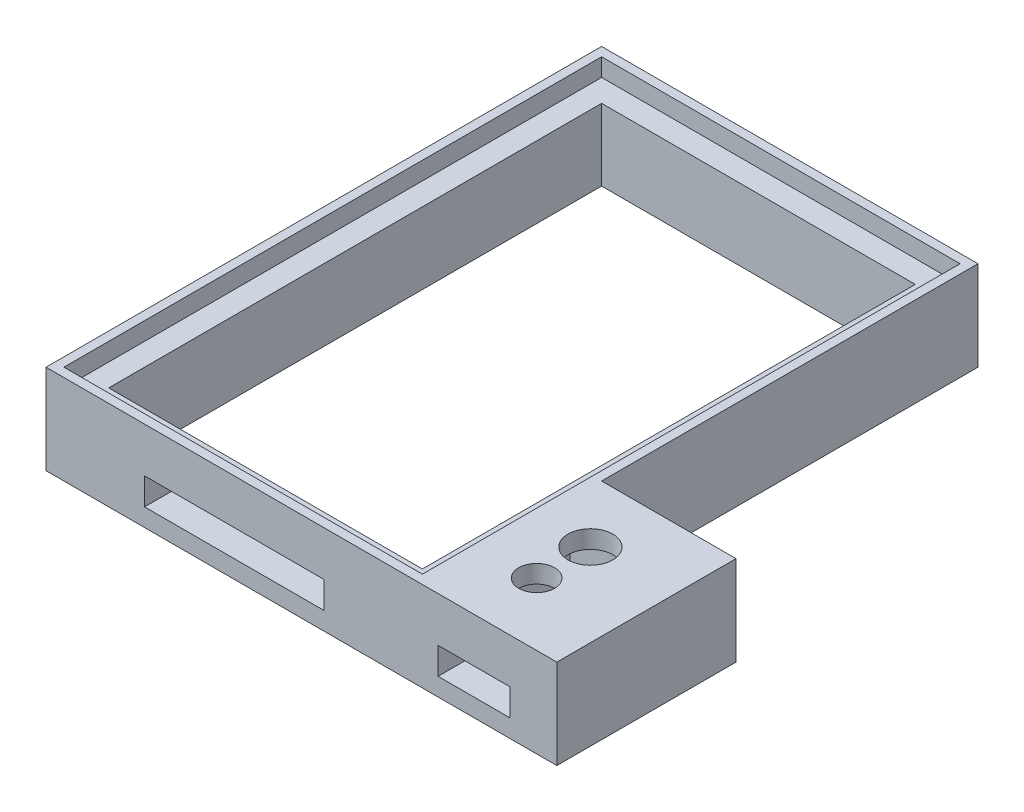
ISO-10303-21;
HEADER;
FILE_DESCRIPTION(('STEP AP214'),'2;1');
FILE_NAME('part.step','',(''),(''),'','','');
FILE_SCHEMA(('AUTOMOTIVE_DESIGN { 1 0 10303 214 1 1 1 1 }'));
ENDSEC;
DATA;
#1=APPLICATION_CONTEXT('core data for automotive mechanical design processes');
#2=APPLICATION_PROTOCOL_DEFINITION('international standard','automotive_design',2000,#1);
#3=PRODUCT_CONTEXT('',#1,'mechanical');
#4=PRODUCT('Part','Part','',(#3));
#5=PRODUCT_RELATED_PRODUCT_CATEGORY('part','',(#4));
#6=PRODUCT_DEFINITION_FORMATION('','',#4);
#7=PRODUCT_DEFINITION_CONTEXT('part definition',#1,'design');
#8=PRODUCT_DEFINITION('design','',#6,#7);
#9=PRODUCT_DEFINITION_SHAPE('','',#8);
#10=(LENGTH_UNIT() NAMED_UNIT(*) SI_UNIT(.MILLI.,.METRE.));
#11=(NAMED_UNIT(*) PLANE_ANGLE_UNIT() SI_UNIT($,.RADIAN.));
#12=(NAMED_UNIT(*) SI_UNIT($,.STERADIAN.) SOLID_ANGLE_UNIT());
#13=UNCERTAINTY_MEASURE_WITH_UNIT(LENGTH_MEASURE(1.E-05),#10,'distance_accuracy_value','');
#14=(GEOMETRIC_REPRESENTATION_CONTEXT(3) GLOBAL_UNCERTAINTY_ASSIGNED_CONTEXT((#13)) GLOBAL_UNIT_ASSIGNED_CONTEXT((#10,
#11,#12)) REPRESENTATION_CONTEXT('',''));
#15=CARTESIAN_POINT('',(0.,0.,0.));
#16=DIRECTION('',(0.,0.,1.));
#17=DIRECTION('',(1.,0.,0.));
#18=AXIS2_PLACEMENT_3D('',#15,#16,#17);
#19=CARTESIAN_POINT('',(21.,10.,31.));
#20=DIRECTION('',(-1.,0.,0.));
#21=DIRECTION('',(0.,0.,1.));
#22=AXIS2_PLACEMENT_3D('',#19,#20,#21);
#23=PLANE('',#22);
#24=DIRECTION('',(0.,1.,0.));
#25=VECTOR('',#24,1.);
#26=CARTESIAN_POINT('',(21.,0.,11.));
#27=LINE('',#26,#25);
#28=CARTESIAN_POINT('',(21.,0.,11.));
#29=VERTEX_POINT('',#28);
#30=CARTESIAN_POINT('',(21.,10.,11.));
#31=VERTEX_POINT('',#30);
#32=EDGE_CURVE('E298',#29,#31,#27,.T.);
#33=ORIENTED_EDGE('',*,*,#32,.F.);
#34=DIRECTION('',(0.,0.,-1.));
#35=VECTOR('',#34,1.);
#36=CARTESIAN_POINT('',(21.,0.,31.));
#37=LINE('',#36,#35);
#38=CARTESIAN_POINT('',(21.,0.,-31.));
#39=VERTEX_POINT('',#38);
#40=EDGE_CURVE('E440',#29,#39,#37,.T.);
#41=ORIENTED_EDGE('',*,*,#40,.T.);
#42=DIRECTION('',(0.,-1.,0.));
#43=VECTOR('',#42,1.);
#44=CARTESIAN_POINT('',(21.,10.,-31.));
#45=LINE('',#44,#43);
#46=CARTESIAN_POINT('',(21.,10.,-31.));
#47=VERTEX_POINT('',#46);
#48=EDGE_CURVE('E481',#47,#39,#45,.T.);
#49=ORIENTED_EDGE('',*,*,#48,.F.);
#50=DIRECTION('',(0.,0.,-1.));
#51=VECTOR('',#50,1.);
#52=CARTESIAN_POINT('',(21.,10.,31.));
#53=LINE('',#52,#51);
#54=EDGE_CURVE('E450',#31,#47,#53,.T.);
#55=ORIENTED_EDGE('',*,*,#54,.F.);
#56=EDGE_LOOP('',(#33,#41,#49,#55));
#57=FACE_BOUND('',#56,.T.);
#58=ADVANCED_FACE('F45',(#57),#23,.F.);
#59=CARTESIAN_POINT('',(0.,8.,0.));
#60=DIRECTION('',(0.,-1.,0.));
#61=DIRECTION('',(0.,0.,-1.));
#62=AXIS2_PLACEMENT_3D('',#59,#60,#61);
#63=PLANE('',#62);
#64=DIRECTION('',(0.,0.,-1.));
#65=VECTOR('',#64,1.);
#66=CARTESIAN_POINT('',(20.,8.,30.));
#67=LINE('',#66,#65);
#68=CARTESIAN_POINT('',(20.,8.,30.));
#69=VERTEX_POINT('',#68);
#70=CARTESIAN_POINT('',(20.,8.,-30.));
#71=VERTEX_POINT('',#70);
#72=EDGE_CURVE('E406',#69,#71,#67,.T.);
#73=ORIENTED_EDGE('',*,*,#72,.T.);
#74=DIRECTION('',(-1.,0.,0.));
#75=VECTOR('',#74,1.);
#76=CARTESIAN_POINT('',(-20.,8.,-30.));
#77=LINE('',#76,#75);
#78=CARTESIAN_POINT('',(-20.,8.,-30.));
#79=VERTEX_POINT('',#78);
#80=EDGE_CURVE('E410',#71,#79,#77,.T.);
#81=ORIENTED_EDGE('',*,*,#80,.T.);
#82=DIRECTION('',(0.,0.,1.));
#83=VECTOR('',#82,1.);
#84=CARTESIAN_POINT('',(-20.,8.,30.));
#85=LINE('',#84,#83);
#86=CARTESIAN_POINT('',(-20.,8.,30.));
#87=VERTEX_POINT('',#86);
#88=EDGE_CURVE('E415',#79,#87,#85,.T.);
#89=ORIENTED_EDGE('',*,*,#88,.T.);
#90=DIRECTION('',(1.,0.,0.));
#91=VECTOR('',#90,1.);
#92=CARTESIAN_POINT('',(-20.,8.,30.));
#93=LINE('',#92,#91);
#94=EDGE_CURVE('E419',#87,#69,#93,.T.);
#95=ORIENTED_EDGE('',*,*,#94,.T.);
#96=EDGE_LOOP('',(#73,#81,#89,#95));
#97=FACE_BOUND('',#96,.T.);
#98=DIRECTION('',(0.,0.,1.));
#99=VECTOR('',#98,1.);
#100=CARTESIAN_POINT('',(-17.5,8.,27.5));
#101=LINE('',#100,#99);
#102=CARTESIAN_POINT('',(-17.5,8.,-27.5));
#103=VERTEX_POINT('',#102);
#104=CARTESIAN_POINT('',(-17.5,8.,27.5));
#105=VERTEX_POINT('',#104);
#106=EDGE_CURVE('E352',#103,#105,#101,.T.);
#107=ORIENTED_EDGE('',*,*,#106,.F.);
#108=DIRECTION('',(-1.,0.,0.));
#109=VECTOR('',#108,1.);
#110=CARTESIAN_POINT('',(17.5,8.,-27.5));
#111=LINE('',#110,#109);
#112=CARTESIAN_POINT('',(17.5,8.,-27.5));
#113=VERTEX_POINT('',#112);
#114=EDGE_CURVE('E367',#113,#103,#111,.T.);
#115=ORIENTED_EDGE('',*,*,#114,.F.);
#116=DIRECTION('',(0.,0.,-1.));
#117=VECTOR('',#116,1.);
#118=CARTESIAN_POINT('',(17.5,8.,27.5));
#119=LINE('',#118,#117);
#120=CARTESIAN_POINT('',(17.5,8.,27.5));
#121=VERTEX_POINT('',#120);
#122=EDGE_CURVE('E387',#121,#113,#119,.T.);
#123=ORIENTED_EDGE('',*,*,#122,.F.);
#124=DIRECTION('',(1.,0.,0.));
#125=VECTOR('',#124,1.);
#126=CARTESIAN_POINT('',(17.5,8.,27.5));
#127=LINE('',#126,#125);
#128=EDGE_CURVE('E383',#105,#121,#127,.T.);
#129=ORIENTED_EDGE('',*,*,#128,.F.);
#130=EDGE_LOOP('',(#107,#115,#123,#129));
#131=FACE_BOUND('',#130,.T.);
#132=ADVANCED_FACE('F533',(#97,#131),#63,.F.);
#133=CARTESIAN_POINT('',(-21.,10.,-31.));
#134=DIRECTION('',(0.,0.,1.));
#135=DIRECTION('',(1.,0.,0.));
#136=AXIS2_PLACEMENT_3D('',#133,#134,#135);
#137=PLANE('',#136);
#138=DIRECTION('',(-1.,0.,0.));
#139=VECTOR('',#138,1.);
#140=CARTESIAN_POINT('',(-21.,0.,-31.));
#141=LINE('',#140,#139);
#142=CARTESIAN_POINT('',(-21.,0.,-31.));
#143=VERTEX_POINT('',#142);
#144=EDGE_CURVE('E466',#39,#143,#141,.T.);
#145=ORIENTED_EDGE('',*,*,#144,.T.);
#146=DIRECTION('',(0.,-1.,0.));
#147=VECTOR('',#146,1.);
#148=CARTESIAN_POINT('',(-21.,10.,-31.));
#149=LINE('',#148,#147);
#150=CARTESIAN_POINT('',(-21.,10.,-31.));
#151=VERTEX_POINT('',#150);
#152=EDGE_CURVE('E477',#151,#143,#149,.T.);
#153=ORIENTED_EDGE('',*,*,#152,.F.);
#154=DIRECTION('',(-1.,0.,0.));
#155=VECTOR('',#154,1.);
#156=CARTESIAN_POINT('',(-21.,10.,-31.));
#157=LINE('',#156,#155);
#158=EDGE_CURVE('E453',#47,#151,#157,.T.);
#159=ORIENTED_EDGE('',*,*,#158,.F.);
#160=ORIENTED_EDGE('',*,*,#48,.T.);
#161=EDGE_LOOP('',(#145,#153,#159,#160));
#162=FACE_BOUND('',#161,.T.);
#163=ADVANCED_FACE('F538',(#162),#137,.F.);
#164=CARTESIAN_POINT('',(-21.,10.,31.));
#165=DIRECTION('',(1.,0.,0.));
#166=DIRECTION('',(0.,0.,-1.));
#167=AXIS2_PLACEMENT_3D('',#164,#165,#166);
#168=PLANE('',#167);
#169=DIRECTION('',(0.,0.,1.));
#170=VECTOR('',#169,1.);
#171=CARTESIAN_POINT('',(-21.,0.,31.));
#172=LINE('',#171,#170);
#173=CARTESIAN_POINT('',(-21.,0.,31.));
#174=VERTEX_POINT('',#173);
#175=EDGE_CURVE('E469',#143,#174,#172,.T.);
#176=ORIENTED_EDGE('',*,*,#175,.T.);
#177=DIRECTION('',(0.,-1.,0.));
#178=VECTOR('',#177,1.);
#179=CARTESIAN_POINT('',(-21.,10.,31.));
#180=LINE('',#179,#178);
#181=CARTESIAN_POINT('',(-21.,10.,31.));
#182=VERTEX_POINT('',#181);
#183=EDGE_CURVE('E463',#182,#174,#180,.T.);
#184=ORIENTED_EDGE('',*,*,#183,.F.);
#185=DIRECTION('',(0.,0.,1.));
#186=VECTOR('',#185,1.);
#187=CARTESIAN_POINT('',(-21.,10.,31.));
#188=LINE('',#187,#186);
#189=EDGE_CURVE('E457',#151,#182,#188,.T.);
#190=ORIENTED_EDGE('',*,*,#189,.F.);
#191=ORIENTED_EDGE('',*,*,#152,.T.);
#192=EDGE_LOOP('',(#176,#184,#190,#191));
#193=FACE_BOUND('',#192,.T.);
#194=ADVANCED_FACE('F563',(#193),#168,.F.);
#195=CARTESIAN_POINT('',(-21.,10.,31.));
#196=DIRECTION('',(0.,0.,-1.));
#197=DIRECTION('',(-1.,0.,0.));
#198=AXIS2_PLACEMENT_3D('',#195,#196,#197);
#199=PLANE('',#198);
#200=DIRECTION('',(-1.,0.,0.));
#201=VECTOR('',#200,1.);
#202=CARTESIAN_POINT('',(22.75,5.,31.));
#203=LINE('',#202,#201);
#204=CARTESIAN_POINT('',(30.75,5.,31.));
#205=VERTEX_POINT('',#204);
#206=CARTESIAN_POINT('',(22.75,5.,31.));
#207=VERTEX_POINT('',#206);
#208=EDGE_CURVE('E231',#205,#207,#203,.T.);
#209=ORIENTED_EDGE('',*,*,#208,.F.);
#210=DIRECTION('',(0.,1.,0.));
#211=VECTOR('',#210,1.);
#212=CARTESIAN_POINT('',(30.75,2.,31.));
#213=LINE('',#212,#211);
#214=CARTESIAN_POINT('',(30.75,2.,31.));
#215=VERTEX_POINT('',#214);
#216=EDGE_CURVE('E60',#215,#205,#213,.T.);
#217=ORIENTED_EDGE('',*,*,#216,.F.);
#218=DIRECTION('',(1.,0.,0.));
#219=VECTOR('',#218,1.);
#220=CARTESIAN_POINT('',(22.75,2.,31.));
#221=LINE('',#220,#219);
#222=CARTESIAN_POINT('',(22.75,2.,31.));
#223=VERTEX_POINT('',#222);
#224=EDGE_CURVE('E239',#223,#215,#221,.T.);
#225=ORIENTED_EDGE('',*,*,#224,.F.);
#226=DIRECTION('',(0.,-1.,0.));
#227=VECTOR('',#226,1.);
#228=CARTESIAN_POINT('',(22.75,2.,31.));
#229=LINE('',#228,#227);
#230=EDGE_CURVE('E221',#207,#223,#229,.T.);
#231=ORIENTED_EDGE('',*,*,#230,.F.);
#232=EDGE_LOOP('',(#209,#217,#225,#231));
#233=FACE_BOUND('',#232,.T.);
#234=DIRECTION('',(-1.,0.,0.));
#235=VECTOR('',#234,1.);
#236=CARTESIAN_POINT('',(-10.,5.,31.));
#237=LINE('',#236,#235);
#238=CARTESIAN_POINT('',(10.,5.,31.));
#239=VERTEX_POINT('',#238);
#240=CARTESIAN_POINT('',(-10.,5.,31.));
#241=VERTEX_POINT('',#240);
#242=EDGE_CURVE('E336',#239,#241,#237,.T.);
#243=ORIENTED_EDGE('',*,*,#242,.F.);
#244=DIRECTION('',(0.,1.,0.));
#245=VECTOR('',#244,1.);
#246=CARTESIAN_POINT('',(10.,2.,31.));
#247=LINE('',#246,#245);
#248=CARTESIAN_POINT('',(10.,2.,31.));
#249=VERTEX_POINT('',#248);
#250=EDGE_CURVE('E333',#249,#239,#247,.T.);
#251=ORIENTED_EDGE('',*,*,#250,.F.);
#252=DIRECTION('',(1.,0.,0.));
#253=VECTOR('',#252,1.);
#254=CARTESIAN_POINT('',(-10.,2.,31.));
#255=LINE('',#254,#253);
#256=CARTESIAN_POINT('',(-10.,2.,31.));
#257=VERTEX_POINT('',#256);
#258=EDGE_CURVE('E344',#257,#249,#255,.T.);
#259=ORIENTED_EDGE('',*,*,#258,.F.);
#260=DIRECTION('',(0.,-1.,0.));
#261=VECTOR('',#260,1.);
#262=CARTESIAN_POINT('',(-10.,2.,31.));
#263=LINE('',#262,#261);
#264=EDGE_CURVE('E340',#241,#257,#263,.T.);
#265=ORIENTED_EDGE('',*,*,#264,.F.);
#266=EDGE_LOOP('',(#243,#251,#259,#265));
#267=FACE_BOUND('',#266,.T.);
#268=DIRECTION('',(1.,0.,0.));
#269=VECTOR('',#268,1.);
#270=CARTESIAN_POINT('',(-21.,0.,31.));
#271=LINE('',#270,#269);
#272=CARTESIAN_POINT('',(36.,0.,31.));
#273=VERTEX_POINT('',#272);
#274=EDGE_CURVE('E454',#174,#273,#271,.T.);
#275=ORIENTED_EDGE('',*,*,#274,.T.);
#276=DIRECTION('',(0.,-1.,0.));
#277=VECTOR('',#276,1.);
#278=CARTESIAN_POINT('',(36.,0.,31.));
#279=LINE('',#278,#277);
#280=CARTESIAN_POINT('',(36.,10.,31.));
#281=VERTEX_POINT('',#280);
#282=EDGE_CURVE('E308',#281,#273,#279,.T.);
#283=ORIENTED_EDGE('',*,*,#282,.F.);
#284=DIRECTION('',(1.,0.,0.));
#285=VECTOR('',#284,1.);
#286=CARTESIAN_POINT('',(-21.,10.,31.));
#287=LINE('',#286,#285);
#288=EDGE_CURVE('E460',#182,#281,#287,.T.);
#289=ORIENTED_EDGE('',*,*,#288,.F.);
#290=ORIENTED_EDGE('',*,*,#183,.T.);
#291=EDGE_LOOP('',(#275,#283,#289,#290));
#292=FACE_BOUND('',#291,.T.);
#293=ADVANCED_FACE('F236',(#233,#267,#292),#199,.F.);
#294=CARTESIAN_POINT('',(0.,10.,0.));
#295=DIRECTION('',(0.,-1.,0.));
#296=DIRECTION('',(0.,0.,-1.));
#297=AXIS2_PLACEMENT_3D('',#294,#295,#296);
#298=PLANE('',#297);
#299=CARTESIAN_POINT('',(26.75,10.,18.));
#300=DIRECTION('',(0.,1.,0.));
#301=DIRECTION('',(0.,0.,1.));
#302=AXIS2_PLACEMENT_3D('',#299,#300,#301);
#303=CIRCLE('',#302,2.5);
#304=CARTESIAN_POINT('',(26.75,10.,20.5));
#305=VERTEX_POINT('',#304);
#306=EDGE_CURVE('E254',#305,#305,#303,.T.);
#307=ORIENTED_EDGE('',*,*,#306,.F.);
#308=EDGE_LOOP('',(#307));
#309=FACE_BOUND('',#308,.T.);
#310=CARTESIAN_POINT('',(26.75,10.,24.));
#311=DIRECTION('',(0.,1.,0.));
#312=DIRECTION('',(0.,0.,1.));
#313=AXIS2_PLACEMENT_3D('',#310,#311,#312);
#314=CIRCLE('',#313,2.);
#315=CARTESIAN_POINT('',(26.75,10.,26.));
#316=VERTEX_POINT('',#315);
#317=EDGE_CURVE('E249',#316,#316,#314,.T.);
#318=ORIENTED_EDGE('',*,*,#317,.F.);
#319=EDGE_LOOP('',(#318));
#320=FACE_BOUND('',#319,.T.);
#321=DIRECTION('',(-1.,0.,0.));
#322=VECTOR('',#321,1.);
#323=CARTESIAN_POINT('',(-20.,10.,-30.));
#324=LINE('',#323,#322);
#325=CARTESIAN_POINT('',(20.,10.,-30.));
#326=VERTEX_POINT('',#325);
#327=CARTESIAN_POINT('',(-20.,10.,-30.));
#328=VERTEX_POINT('',#327);
#329=EDGE_CURVE('E426',#326,#328,#324,.T.);
#330=ORIENTED_EDGE('',*,*,#329,.F.);
#331=DIRECTION('',(0.,0.,-1.));
#332=VECTOR('',#331,1.);
#333=CARTESIAN_POINT('',(20.,10.,30.));
#334=LINE('',#333,#332);
#335=CARTESIAN_POINT('',(20.,10.,30.));
#336=VERTEX_POINT('',#335);
#337=EDGE_CURVE('E396',#336,#326,#334,.T.);
#338=ORIENTED_EDGE('',*,*,#337,.F.);
#339=DIRECTION('',(1.,0.,0.));
#340=VECTOR('',#339,1.);
#341=CARTESIAN_POINT('',(-20.,10.,30.));
#342=LINE('',#341,#340);
#343=CARTESIAN_POINT('',(-20.,10.,30.));
#344=VERTEX_POINT('',#343);
#345=EDGE_CURVE('E411',#344,#336,#342,.T.);
#346=ORIENTED_EDGE('',*,*,#345,.F.);
#347=DIRECTION('',(0.,0.,1.));
#348=VECTOR('',#347,1.);
#349=CARTESIAN_POINT('',(-20.,10.,30.));
#350=LINE('',#349,#348);
#351=EDGE_CURVE('E430',#328,#344,#350,.T.);
#352=ORIENTED_EDGE('',*,*,#351,.F.);
#353=EDGE_LOOP('',(#330,#338,#346,#352));
#354=FACE_BOUND('',#353,.T.);
#355=ORIENTED_EDGE('',*,*,#288,.T.);
#356=DIRECTION('',(0.,0.,1.));
#357=VECTOR('',#356,1.);
#358=CARTESIAN_POINT('',(36.,10.,31.));
#359=LINE('',#358,#357);
#360=CARTESIAN_POINT('',(36.,10.,11.));
#361=VERTEX_POINT('',#360);
#362=EDGE_CURVE('E318',#361,#281,#359,.T.);
#363=ORIENTED_EDGE('',*,*,#362,.F.);
#364=DIRECTION('',(-1.,0.,0.));
#365=VECTOR('',#364,1.);
#366=CARTESIAN_POINT('',(36.,10.,11.));
#367=LINE('',#366,#365);
#368=EDGE_CURVE('E322',#361,#31,#367,.T.);
#369=ORIENTED_EDGE('',*,*,#368,.T.);
#370=ORIENTED_EDGE('',*,*,#54,.T.);
#371=ORIENTED_EDGE('',*,*,#158,.T.);
#372=ORIENTED_EDGE('',*,*,#189,.T.);
#373=EDGE_LOOP('',(#355,#363,#369,#370,#371,#372));
#374=FACE_BOUND('',#373,.T.);
#375=ADVANCED_FACE('F568',(#309,#320,#354,#374),#298,.F.);
#376=CARTESIAN_POINT('',(0.,0.,0.));
#377=DIRECTION('',(0.,-1.,0.));
#378=DIRECTION('',(0.,0.,-1.));
#379=AXIS2_PLACEMENT_3D('',#376,#377,#378);
#380=PLANE('',#379);
#381=DIRECTION('',(0.,0.,-1.));
#382=VECTOR('',#381,1.);
#383=CARTESIAN_POINT('',(21.,0.,14.5));
#384=LINE('',#383,#382);
#385=CARTESIAN_POINT('',(21.,0.,27.5));
#386=VERTEX_POINT('',#385);
#387=CARTESIAN_POINT('',(21.,0.,14.5));
#388=VERTEX_POINT('',#387);
#389=EDGE_CURVE('E280',#386,#388,#384,.T.);
#390=ORIENTED_EDGE('',*,*,#389,.F.);
#391=DIRECTION('',(-1.,0.,0.));
#392=VECTOR('',#391,1.);
#393=CARTESIAN_POINT('',(21.,0.,27.5));
#394=LINE('',#393,#392);
#395=CARTESIAN_POINT('',(32.5,0.,27.5));
#396=VERTEX_POINT('',#395);
#397=EDGE_CURVE('E267',#396,#386,#394,.T.);
#398=ORIENTED_EDGE('',*,*,#397,.F.);
#399=DIRECTION('',(0.,0.,1.));
#400=VECTOR('',#399,1.);
#401=CARTESIAN_POINT('',(32.5,0.,14.5));
#402=LINE('',#401,#400);
#403=CARTESIAN_POINT('',(32.5,0.,14.5));
#404=VERTEX_POINT('',#403);
#405=EDGE_CURVE('E288',#404,#396,#402,.T.);
#406=ORIENTED_EDGE('',*,*,#405,.F.);
#407=DIRECTION('',(1.,0.,0.));
#408=VECTOR('',#407,1.);
#409=CARTESIAN_POINT('',(21.,0.,14.5));
#410=LINE('',#409,#408);
#411=EDGE_CURVE('E283',#388,#404,#410,.T.);
#412=ORIENTED_EDGE('',*,*,#411,.F.);
#413=EDGE_LOOP('',(#390,#398,#406,#412));
#414=FACE_BOUND('',#413,.T.);
#415=DIRECTION('',(0.,0.,1.));
#416=VECTOR('',#415,1.);
#417=CARTESIAN_POINT('',(-17.5,0.,27.5));
#418=LINE('',#417,#416);
#419=CARTESIAN_POINT('',(-17.5,0.,-27.5));
#420=VERTEX_POINT('',#419);
#421=CARTESIAN_POINT('',(-17.5,0.,27.5));
#422=VERTEX_POINT('',#421);
#423=EDGE_CURVE('E362',#420,#422,#418,.T.);
#424=ORIENTED_EDGE('',*,*,#423,.T.);
#425=DIRECTION('',(1.,0.,0.));
#426=VECTOR('',#425,1.);
#427=CARTESIAN_POINT('',(17.5,0.,27.5));
#428=LINE('',#427,#426);
#429=CARTESIAN_POINT('',(17.5,0.,27.5));
#430=VERTEX_POINT('',#429);
#431=EDGE_CURVE('E366',#422,#430,#428,.T.);
#432=ORIENTED_EDGE('',*,*,#431,.T.);
#433=DIRECTION('',(0.,0.,-1.));
#434=VECTOR('',#433,1.);
#435=CARTESIAN_POINT('',(17.5,0.,27.5));
#436=LINE('',#435,#434);
#437=CARTESIAN_POINT('',(17.5,0.,-27.5));
#438=VERTEX_POINT('',#437);
#439=EDGE_CURVE('E371',#430,#438,#436,.T.);
#440=ORIENTED_EDGE('',*,*,#439,.T.);
#441=DIRECTION('',(-1.,0.,0.));
#442=VECTOR('',#441,1.);
#443=CARTESIAN_POINT('',(17.5,0.,-27.5));
#444=LINE('',#443,#442);
#445=EDGE_CURVE('E375',#438,#420,#444,.T.);
#446=ORIENTED_EDGE('',*,*,#445,.T.);
#447=EDGE_LOOP('',(#424,#432,#440,#446));
#448=FACE_BOUND('',#447,.T.);
#449=ORIENTED_EDGE('',*,*,#40,.F.);
#450=DIRECTION('',(-1.,0.,0.));
#451=VECTOR('',#450,1.);
#452=CARTESIAN_POINT('',(36.,0.,11.));
#453=LINE('',#452,#451);
#454=CARTESIAN_POINT('',(36.,0.,11.));
#455=VERTEX_POINT('',#454);
#456=EDGE_CURVE('E329',#455,#29,#453,.T.);
#457=ORIENTED_EDGE('',*,*,#456,.F.);
#458=DIRECTION('',(0.,0.,-1.));
#459=VECTOR('',#458,1.);
#460=CARTESIAN_POINT('',(36.,0.,31.));
#461=LINE('',#460,#459);
#462=EDGE_CURVE('E312',#273,#455,#461,.T.);
#463=ORIENTED_EDGE('',*,*,#462,.F.);
#464=ORIENTED_EDGE('',*,*,#274,.F.);
#465=ORIENTED_EDGE('',*,*,#175,.F.);
#466=ORIENTED_EDGE('',*,*,#144,.F.);
#467=EDGE_LOOP('',(#449,#457,#463,#464,#465,#466));
#468=FACE_BOUND('',#467,.T.);
#469=ADVANCED_FACE('F548',(#414,#448,#468),#380,.T.);
#470=CARTESIAN_POINT('',(20.,8.,30.));
#471=DIRECTION('',(1.,0.,0.));
#472=DIRECTION('',(0.,0.,-1.));
#473=AXIS2_PLACEMENT_3D('',#470,#471,#472);
#474=PLANE('',#473);
#475=ORIENTED_EDGE('',*,*,#337,.T.);
#476=DIRECTION('',(0.,1.,0.));
#477=VECTOR('',#476,1.);
#478=CARTESIAN_POINT('',(20.,8.,-30.));
#479=LINE('',#478,#477);
#480=EDGE_CURVE('E423',#71,#326,#479,.T.);
#481=ORIENTED_EDGE('',*,*,#480,.F.);
#482=ORIENTED_EDGE('',*,*,#72,.F.);
#483=DIRECTION('',(0.,1.,0.));
#484=VECTOR('',#483,1.);
#485=CARTESIAN_POINT('',(20.,8.,30.));
#486=LINE('',#485,#484);
#487=EDGE_CURVE('E437',#69,#336,#486,.T.);
#488=ORIENTED_EDGE('',*,*,#487,.T.);
#489=EDGE_LOOP('',(#475,#481,#482,#488));
#490=FACE_BOUND('',#489,.T.);
#491=ADVANCED_FACE('F576',(#490),#474,.F.);
#492=CARTESIAN_POINT('',(-20.,8.,30.));
#493=DIRECTION('',(0.,0.,1.));
#494=DIRECTION('',(1.,0.,0.));
#495=AXIS2_PLACEMENT_3D('',#492,#493,#494);
#496=PLANE('',#495);
#497=ORIENTED_EDGE('',*,*,#345,.T.);
#498=ORIENTED_EDGE('',*,*,#487,.F.);
#499=ORIENTED_EDGE('',*,*,#94,.F.);
#500=DIRECTION('',(0.,1.,0.));
#501=VECTOR('',#500,1.);
#502=CARTESIAN_POINT('',(-20.,8.,30.));
#503=LINE('',#502,#501);
#504=EDGE_CURVE('E441',#87,#344,#503,.T.);
#505=ORIENTED_EDGE('',*,*,#504,.T.);
#506=EDGE_LOOP('',(#497,#498,#499,#505));
#507=FACE_BOUND('',#506,.T.);
#508=ADVANCED_FACE('F598',(#507),#496,.F.);
#509=CARTESIAN_POINT('',(-20.,8.,30.));
#510=DIRECTION('',(-1.,0.,0.));
#511=DIRECTION('',(0.,0.,1.));
#512=AXIS2_PLACEMENT_3D('',#509,#510,#511);
#513=PLANE('',#512);
#514=ORIENTED_EDGE('',*,*,#351,.T.);
#515=ORIENTED_EDGE('',*,*,#504,.F.);
#516=ORIENTED_EDGE('',*,*,#88,.F.);
#517=DIRECTION('',(0.,1.,0.));
#518=VECTOR('',#517,1.);
#519=CARTESIAN_POINT('',(-20.,8.,-30.));
#520=LINE('',#519,#518);
#521=EDGE_CURVE('E444',#79,#328,#520,.T.);
#522=ORIENTED_EDGE('',*,*,#521,.T.);
#523=EDGE_LOOP('',(#514,#515,#516,#522));
#524=FACE_BOUND('',#523,.T.);
#525=ADVANCED_FACE('F605',(#524),#513,.F.);
#526=CARTESIAN_POINT('',(-20.,8.,-30.));
#527=DIRECTION('',(0.,0.,-1.));
#528=DIRECTION('',(-1.,0.,0.));
#529=AXIS2_PLACEMENT_3D('',#526,#527,#528);
#530=PLANE('',#529);
#531=ORIENTED_EDGE('',*,*,#329,.T.);
#532=ORIENTED_EDGE('',*,*,#521,.F.);
#533=ORIENTED_EDGE('',*,*,#80,.F.);
#534=ORIENTED_EDGE('',*,*,#480,.T.);
#535=EDGE_LOOP('',(#531,#532,#533,#534));
#536=FACE_BOUND('',#535,.T.);
#537=ADVANCED_FACE('F613',(#536),#530,.F.);
#538=CARTESIAN_POINT('',(-17.5,0.,27.5));
#539=DIRECTION('',(-1.,0.,0.));
#540=DIRECTION('',(0.,0.,1.));
#541=AXIS2_PLACEMENT_3D('',#538,#539,#540);
#542=PLANE('',#541);
#543=ORIENTED_EDGE('',*,*,#106,.T.);
#544=DIRECTION('',(0.,1.,0.));
#545=VECTOR('',#544,1.);
#546=CARTESIAN_POINT('',(-17.5,0.,27.5));
#547=LINE('',#546,#545);
#548=EDGE_CURVE('E379',#422,#105,#547,.T.);
#549=ORIENTED_EDGE('',*,*,#548,.F.);
#550=ORIENTED_EDGE('',*,*,#423,.F.);
#551=DIRECTION('',(0.,1.,0.));
#552=VECTOR('',#551,1.);
#553=CARTESIAN_POINT('',(-17.5,0.,-27.5));
#554=LINE('',#553,#552);
#555=EDGE_CURVE('E393',#420,#103,#554,.T.);
#556=ORIENTED_EDGE('',*,*,#555,.T.);
#557=EDGE_LOOP('',(#543,#549,#550,#556));
#558=FACE_BOUND('',#557,.T.);
#559=ADVANCED_FACE('F621',(#558),#542,.F.);
#560=CARTESIAN_POINT('',(17.5,0.,-27.5));
#561=DIRECTION('',(0.,0.,-1.));
#562=DIRECTION('',(-1.,0.,0.));
#563=AXIS2_PLACEMENT_3D('',#560,#561,#562);
#564=PLANE('',#563);
#565=ORIENTED_EDGE('',*,*,#114,.T.);
#566=ORIENTED_EDGE('',*,*,#555,.F.);
#567=ORIENTED_EDGE('',*,*,#445,.F.);
#568=DIRECTION('',(0.,1.,0.));
#569=VECTOR('',#568,1.);
#570=CARTESIAN_POINT('',(17.5,0.,-27.5));
#571=LINE('',#570,#569);
#572=EDGE_CURVE('E397',#438,#113,#571,.T.);
#573=ORIENTED_EDGE('',*,*,#572,.T.);
#574=EDGE_LOOP('',(#565,#566,#567,#573));
#575=FACE_BOUND('',#574,.T.);
#576=ADVANCED_FACE('F629',(#575),#564,.F.);
#577=CARTESIAN_POINT('',(17.5,0.,27.5));
#578=DIRECTION('',(1.,0.,0.));
#579=DIRECTION('',(0.,0.,-1.));
#580=AXIS2_PLACEMENT_3D('',#577,#578,#579);
#581=PLANE('',#580);
#582=ORIENTED_EDGE('',*,*,#122,.T.);
#583=ORIENTED_EDGE('',*,*,#572,.F.);
#584=ORIENTED_EDGE('',*,*,#439,.F.);
#585=DIRECTION('',(0.,1.,0.));
#586=VECTOR('',#585,1.);
#587=CARTESIAN_POINT('',(17.5,0.,27.5));
#588=LINE('',#587,#586);
#589=EDGE_CURVE('E401',#430,#121,#588,.T.);
#590=ORIENTED_EDGE('',*,*,#589,.T.);
#591=EDGE_LOOP('',(#582,#583,#584,#590));
#592=FACE_BOUND('',#591,.T.);
#593=ADVANCED_FACE('F637',(#592),#581,.F.);
#594=CARTESIAN_POINT('',(17.5,0.,27.5));
#595=DIRECTION('',(0.,0.,1.));
#596=DIRECTION('',(1.,0.,0.));
#597=AXIS2_PLACEMENT_3D('',#594,#595,#596);
#598=PLANE('',#597);
#599=DIRECTION('',(1.,0.,0.));
#600=VECTOR('',#599,1.);
#601=CARTESIAN_POINT('',(17.5,2.,27.5));
#602=LINE('',#601,#600);
#603=CARTESIAN_POINT('',(-10.,2.,27.5));
#604=VERTEX_POINT('',#603);
#605=CARTESIAN_POINT('',(10.,2.,27.5));
#606=VERTEX_POINT('',#605);
#607=EDGE_CURVE('E493',#604,#606,#602,.T.);
#608=ORIENTED_EDGE('',*,*,#607,.T.);
#609=DIRECTION('',(0.,1.,0.));
#610=VECTOR('',#609,1.);
#611=CARTESIAN_POINT('',(10.,0.,27.5));
#612=LINE('',#611,#610);
#613=CARTESIAN_POINT('',(10.,5.,27.5));
#614=VERTEX_POINT('',#613);
#615=EDGE_CURVE('E497',#606,#614,#612,.T.);
#616=ORIENTED_EDGE('',*,*,#615,.T.);
#617=DIRECTION('',(-1.,0.,0.));
#618=VECTOR('',#617,1.);
#619=CARTESIAN_POINT('',(17.5,5.,27.5));
#620=LINE('',#619,#618);
#621=CARTESIAN_POINT('',(-9.99999999999999,5.,27.5));
#622=VERTEX_POINT('',#621);
#623=EDGE_CURVE('E485',#614,#622,#620,.T.);
#624=ORIENTED_EDGE('',*,*,#623,.T.);
#625=DIRECTION('',(0.,-1.,0.));
#626=VECTOR('',#625,1.);
#627=CARTESIAN_POINT('',(-10.,0.,27.5));
#628=LINE('',#627,#626);
#629=EDGE_CURVE('E489',#622,#604,#628,.T.);
#630=ORIENTED_EDGE('',*,*,#629,.T.);
#631=EDGE_LOOP('',(#608,#616,#624,#630));
#632=FACE_BOUND('',#631,.T.);
#633=ORIENTED_EDGE('',*,*,#128,.T.);
#634=ORIENTED_EDGE('',*,*,#589,.F.);
#635=ORIENTED_EDGE('',*,*,#431,.F.);
#636=ORIENTED_EDGE('',*,*,#548,.T.);
#637=EDGE_LOOP('',(#633,#634,#635,#636));
#638=FACE_BOUND('',#637,.T.);
#639=ADVANCED_FACE('F645',(#632,#638),#598,.F.);
#640=CARTESIAN_POINT('',(10.,2.,23.));
#641=DIRECTION('',(1.,0.,0.));
#642=DIRECTION('',(0.,0.,-1.));
#643=AXIS2_PLACEMENT_3D('',#640,#641,#642);
#644=PLANE('',#643);
#645=DIRECTION('',(0.,0.,1.));
#646=VECTOR('',#645,1.);
#647=CARTESIAN_POINT('',(10.,2.,23.));
#648=LINE('',#647,#646);
#649=EDGE_CURVE('E349',#606,#249,#648,.T.);
#650=ORIENTED_EDGE('',*,*,#649,.T.);
#651=ORIENTED_EDGE('',*,*,#250,.T.);
#652=DIRECTION('',(0.,0.,1.));
#653=VECTOR('',#652,1.);
#654=CARTESIAN_POINT('',(10.,5.,23.));
#655=LINE('',#654,#653);
#656=EDGE_CURVE('E348',#614,#239,#655,.T.);
#657=ORIENTED_EDGE('',*,*,#656,.F.);
#658=ORIENTED_EDGE('',*,*,#615,.F.);
#659=EDGE_LOOP('',(#650,#651,#657,#658));
#660=FACE_BOUND('',#659,.T.);
#661=ADVANCED_FACE('F654',(#660),#644,.F.);
#662=CARTESIAN_POINT('',(-10.,2.,23.));
#663=DIRECTION('',(0.,-1.,0.));
#664=DIRECTION('',(0.,0.,-1.));
#665=AXIS2_PLACEMENT_3D('',#662,#663,#664);
#666=PLANE('',#665);
#667=DIRECTION('',(0.,0.,1.));
#668=VECTOR('',#667,1.);
#669=CARTESIAN_POINT('',(-10.,2.,23.));
#670=LINE('',#669,#668);
#671=EDGE_CURVE('E353',#604,#257,#670,.T.);
#672=ORIENTED_EDGE('',*,*,#671,.T.);
#673=ORIENTED_EDGE('',*,*,#258,.T.);
#674=ORIENTED_EDGE('',*,*,#649,.F.);
#675=ORIENTED_EDGE('',*,*,#607,.F.);
#676=EDGE_LOOP('',(#672,#673,#674,#675));
#677=FACE_BOUND('',#676,.T.);
#678=ADVANCED_FACE('F810',(#677),#666,.F.);
#679=CARTESIAN_POINT('',(-10.,2.,23.));
#680=DIRECTION('',(-1.,0.,0.));
#681=DIRECTION('',(0.,0.,1.));
#682=AXIS2_PLACEMENT_3D('',#679,#680,#681);
#683=PLANE('',#682);
#684=DIRECTION('',(0.,0.,1.));
#685=VECTOR('',#684,1.);
#686=CARTESIAN_POINT('',(-10.,5.,23.));
#687=LINE('',#686,#685);
#688=EDGE_CURVE('E356',#622,#241,#687,.T.);
#689=ORIENTED_EDGE('',*,*,#688,.T.);
#690=ORIENTED_EDGE('',*,*,#264,.T.);
#691=ORIENTED_EDGE('',*,*,#671,.F.);
#692=ORIENTED_EDGE('',*,*,#629,.F.);
#693=EDGE_LOOP('',(#689,#690,#691,#692));
#694=FACE_BOUND('',#693,.T.);
#695=ADVANCED_FACE('F801',(#694),#683,.F.);
#696=CARTESIAN_POINT('',(-10.,5.,23.));
#697=DIRECTION('',(0.,1.,0.));
#698=DIRECTION('',(0.,0.,1.));
#699=AXIS2_PLACEMENT_3D('',#696,#697,#698);
#700=PLANE('',#699);
#701=ORIENTED_EDGE('',*,*,#656,.T.);
#702=ORIENTED_EDGE('',*,*,#242,.T.);
#703=ORIENTED_EDGE('',*,*,#688,.F.);
#704=ORIENTED_EDGE('',*,*,#623,.F.);
#705=EDGE_LOOP('',(#701,#702,#703,#704));
#706=FACE_BOUND('',#705,.T.);
#707=ADVANCED_FACE('F788',(#706),#700,.F.);
#708=CARTESIAN_POINT('',(36.,0.,11.));
#709=DIRECTION('',(0.,0.,1.));
#710=DIRECTION('',(1.,0.,0.));
#711=AXIS2_PLACEMENT_3D('',#708,#709,#710);
#712=PLANE('',#711);
#713=ORIENTED_EDGE('',*,*,#32,.T.);
#714=ORIENTED_EDGE('',*,*,#368,.F.);
#715=DIRECTION('',(0.,1.,0.));
#716=VECTOR('',#715,1.);
#717=CARTESIAN_POINT('',(36.,0.,11.));
#718=LINE('',#717,#716);
#719=EDGE_CURVE('E315',#455,#361,#718,.T.);
#720=ORIENTED_EDGE('',*,*,#719,.F.);
#721=ORIENTED_EDGE('',*,*,#456,.T.);
#722=EDGE_LOOP('',(#713,#714,#720,#721));
#723=FACE_BOUND('',#722,.T.);
#724=ADVANCED_FACE('F552',(#723),#712,.F.);
#725=CARTESIAN_POINT('',(36.,0.,0.));
#726=DIRECTION('',(-1.,0.,0.));
#727=DIRECTION('',(0.,0.,1.));
#728=AXIS2_PLACEMENT_3D('',#725,#726,#727);
#729=PLANE('',#728);
#730=ORIENTED_EDGE('',*,*,#282,.T.);
#731=ORIENTED_EDGE('',*,*,#462,.T.);
#732=ORIENTED_EDGE('',*,*,#719,.T.);
#733=ORIENTED_EDGE('',*,*,#362,.T.);
#734=EDGE_LOOP('',(#730,#731,#732,#733));
#735=FACE_BOUND('',#734,.T.);
#736=ADVANCED_FACE('F555',(#735),#729,.F.);
#737=CARTESIAN_POINT('',(21.,8.,14.5));
#738=DIRECTION('',(-1.,0.,0.));
#739=DIRECTION('',(0.,0.,1.));
#740=AXIS2_PLACEMENT_3D('',#737,#738,#739);
#741=PLANE('',#740);
#742=ORIENTED_EDGE('',*,*,#389,.T.);
#743=DIRECTION('',(0.,-1.,0.));
#744=VECTOR('',#743,1.);
#745=CARTESIAN_POINT('',(21.,8.,14.5));
#746=LINE('',#745,#744);
#747=CARTESIAN_POINT('',(21.,8.,14.5));
#748=VERTEX_POINT('',#747);
#749=EDGE_CURVE('E279',#748,#388,#746,.T.);
#750=ORIENTED_EDGE('',*,*,#749,.F.);
#751=DIRECTION('',(0.,0.,-1.));
#752=VECTOR('',#751,1.);
#753=CARTESIAN_POINT('',(21.,8.,14.5));
#754=LINE('',#753,#752);
#755=CARTESIAN_POINT('',(21.,8.,27.5));
#756=VERTEX_POINT('',#755);
#757=EDGE_CURVE('E262',#756,#748,#754,.T.);
#758=ORIENTED_EDGE('',*,*,#757,.F.);
#759=DIRECTION('',(0.,-1.,0.));
#760=VECTOR('',#759,1.);
#761=CARTESIAN_POINT('',(21.,8.,27.5));
#762=LINE('',#761,#760);
#763=EDGE_CURVE('E295',#756,#386,#762,.T.);
#764=ORIENTED_EDGE('',*,*,#763,.T.);
#765=EDGE_LOOP('',(#742,#750,#758,#764));
#766=FACE_BOUND('',#765,.T.);
#767=ADVANCED_FACE('F686',(#766),#741,.F.);
#768=CARTESIAN_POINT('',(21.,8.,27.5));
#769=DIRECTION('',(0.,0.,1.));
#770=DIRECTION('',(1.,0.,0.));
#771=AXIS2_PLACEMENT_3D('',#768,#769,#770);
#772=PLANE('',#771);
#773=DIRECTION('',(1.,0.,0.));
#774=VECTOR('',#773,1.);
#775=CARTESIAN_POINT('',(21.,2.,27.5));
#776=LINE('',#775,#774);
#777=CARTESIAN_POINT('',(22.75,2.,27.5));
#778=VERTEX_POINT('',#777);
#779=CARTESIAN_POINT('',(30.75,2.,27.5));
#780=VERTEX_POINT('',#779);
#781=EDGE_CURVE('E53',#778,#780,#776,.T.);
#782=ORIENTED_EDGE('',*,*,#781,.T.);
#783=DIRECTION('',(0.,1.,0.));
#784=VECTOR('',#783,1.);
#785=CARTESIAN_POINT('',(30.75,8.,27.5));
#786=LINE('',#785,#784);
#787=CARTESIAN_POINT('',(30.75,5.,27.5));
#788=VERTEX_POINT('',#787);
#789=EDGE_CURVE('E11',#780,#788,#786,.T.);
#790=ORIENTED_EDGE('',*,*,#789,.T.);
#791=DIRECTION('',(-1.,0.,0.));
#792=VECTOR('',#791,1.);
#793=CARTESIAN_POINT('',(21.,5.,27.5));
#794=LINE('',#793,#792);
#795=CARTESIAN_POINT('',(22.75,5.,27.5));
#796=VERTEX_POINT('',#795);
#797=EDGE_CURVE('E501',#788,#796,#794,.T.);
#798=ORIENTED_EDGE('',*,*,#797,.T.);
#799=DIRECTION('',(0.,-1.,0.));
#800=VECTOR('',#799,1.);
#801=CARTESIAN_POINT('',(22.75,8.,27.5));
#802=LINE('',#801,#800);
#803=EDGE_CURVE('E224',#796,#778,#802,.T.);
#804=ORIENTED_EDGE('',*,*,#803,.T.);
#805=EDGE_LOOP('',(#782,#790,#798,#804));
#806=FACE_BOUND('',#805,.T.);
#807=ORIENTED_EDGE('',*,*,#397,.T.);
#808=ORIENTED_EDGE('',*,*,#763,.F.);
#809=DIRECTION('',(-1.,0.,0.));
#810=VECTOR('',#809,1.);
#811=CARTESIAN_POINT('',(21.,8.,27.5));
#812=LINE('',#811,#810);
#813=CARTESIAN_POINT('',(32.5,8.,27.5));
#814=VERTEX_POINT('',#813);
#815=EDGE_CURVE('E275',#814,#756,#812,.T.);
#816=ORIENTED_EDGE('',*,*,#815,.F.);
#817=DIRECTION('',(0.,-1.,0.));
#818=VECTOR('',#817,1.);
#819=CARTESIAN_POINT('',(32.5,8.,27.5));
#820=LINE('',#819,#818);
#821=EDGE_CURVE('E299',#814,#396,#820,.T.);
#822=ORIENTED_EDGE('',*,*,#821,.T.);
#823=EDGE_LOOP('',(#807,#808,#816,#822));
#824=FACE_BOUND('',#823,.T.);
#825=ADVANCED_FACE('F514',(#806,#824),#772,.F.);
#826=CARTESIAN_POINT('',(32.5,8.,14.5));
#827=DIRECTION('',(1.,0.,0.));
#828=DIRECTION('',(0.,0.,-1.));
#829=AXIS2_PLACEMENT_3D('',#826,#827,#828);
#830=PLANE('',#829);
#831=ORIENTED_EDGE('',*,*,#405,.T.);
#832=ORIENTED_EDGE('',*,*,#821,.F.);
#833=DIRECTION('',(0.,0.,1.));
#834=VECTOR('',#833,1.);
#835=CARTESIAN_POINT('',(32.5,8.,14.5));
#836=LINE('',#835,#834);
#837=CARTESIAN_POINT('',(32.5,8.,14.5));
#838=VERTEX_POINT('',#837);
#839=EDGE_CURVE('E271',#838,#814,#836,.T.);
#840=ORIENTED_EDGE('',*,*,#839,.F.);
#841=DIRECTION('',(0.,-1.,0.));
#842=VECTOR('',#841,1.);
#843=CARTESIAN_POINT('',(32.5,8.,14.5));
#844=LINE('',#843,#842);
#845=EDGE_CURVE('E302',#838,#404,#844,.T.);
#846=ORIENTED_EDGE('',*,*,#845,.T.);
#847=EDGE_LOOP('',(#831,#832,#840,#846));
#848=FACE_BOUND('',#847,.T.);
#849=ADVANCED_FACE('F685',(#848),#830,.F.);
#850=CARTESIAN_POINT('',(21.,8.,14.5));
#851=DIRECTION('',(0.,0.,-1.));
#852=DIRECTION('',(-1.,0.,0.));
#853=AXIS2_PLACEMENT_3D('',#850,#851,#852);
#854=PLANE('',#853);
#855=ORIENTED_EDGE('',*,*,#411,.T.);
#856=ORIENTED_EDGE('',*,*,#845,.F.);
#857=DIRECTION('',(1.,0.,0.));
#858=VECTOR('',#857,1.);
#859=CARTESIAN_POINT('',(21.,8.,14.5));
#860=LINE('',#859,#858);
#861=EDGE_CURVE('E266',#748,#838,#860,.T.);
#862=ORIENTED_EDGE('',*,*,#861,.F.);
#863=ORIENTED_EDGE('',*,*,#749,.T.);
#864=EDGE_LOOP('',(#855,#856,#862,#863));
#865=FACE_BOUND('',#864,.T.);
#866=ADVANCED_FACE('F747',(#865),#854,.F.);
#867=CARTESIAN_POINT('',(0.,8.,0.));
#868=DIRECTION('',(0.,1.,0.));
#869=DIRECTION('',(0.,0.,1.));
#870=AXIS2_PLACEMENT_3D('',#867,#868,#869);
#871=PLANE('',#870);
#872=CARTESIAN_POINT('',(26.75,8.,18.));
#873=DIRECTION('',(0.,1.,0.));
#874=DIRECTION('',(0.,0.,1.));
#875=AXIS2_PLACEMENT_3D('',#872,#873,#874);
#876=CIRCLE('',#875,2.5);
#877=CARTESIAN_POINT('',(26.75,8.,20.5));
#878=VERTEX_POINT('',#877);
#879=EDGE_CURVE('E284',#878,#878,#876,.T.);
#880=ORIENTED_EDGE('',*,*,#879,.T.);
#881=EDGE_LOOP('',(#880));
#882=FACE_BOUND('',#881,.T.);
#883=CARTESIAN_POINT('',(26.75,8.,24.));
#884=DIRECTION('',(0.,1.,0.));
#885=DIRECTION('',(0.,0.,1.));
#886=AXIS2_PLACEMENT_3D('',#883,#884,#885);
#887=CIRCLE('',#886,2.);
#888=CARTESIAN_POINT('',(26.75,8.,26.));
#889=VERTEX_POINT('',#888);
#890=EDGE_CURVE('E258',#889,#889,#887,.T.);
#891=ORIENTED_EDGE('',*,*,#890,.T.);
#892=EDGE_LOOP('',(#891));
#893=FACE_BOUND('',#892,.T.);
#894=ORIENTED_EDGE('',*,*,#757,.T.);
#895=ORIENTED_EDGE('',*,*,#861,.T.);
#896=ORIENTED_EDGE('',*,*,#839,.T.);
#897=ORIENTED_EDGE('',*,*,#815,.T.);
#898=EDGE_LOOP('',(#894,#895,#896,#897));
#899=FACE_BOUND('',#898,.T.);
#900=ADVANCED_FACE('F738',(#882,#893,#899),#871,.F.);
#901=CARTESIAN_POINT('',(26.75,2.,24.));
#902=DIRECTION('',(0.,1.,0.));
#903=DIRECTION('',(0.,0.,1.));
#904=AXIS2_PLACEMENT_3D('',#901,#902,#903);
#905=CYLINDRICAL_SURFACE('',#904,2.);
#906=ORIENTED_EDGE('',*,*,#317,.T.);
#907=EDGE_LOOP('',(#906));
#908=FACE_BOUND('',#907,.T.);
#909=ORIENTED_EDGE('',*,*,#890,.F.);
#910=EDGE_LOOP('',(#909));
#911=FACE_BOUND('',#910,.T.);
#912=ADVANCED_FACE('F528',(#908,#911),#905,.F.);
#913=CARTESIAN_POINT('',(26.75,2.,18.));
#914=DIRECTION('',(0.,1.,0.));
#915=DIRECTION('',(0.,0.,1.));
#916=AXIS2_PLACEMENT_3D('',#913,#914,#915);
#917=CYLINDRICAL_SURFACE('',#916,2.5);
#918=ORIENTED_EDGE('',*,*,#306,.T.);
#919=EDGE_LOOP('',(#918));
#920=FACE_BOUND('',#919,.T.);
#921=ORIENTED_EDGE('',*,*,#879,.F.);
#922=EDGE_LOOP('',(#921));
#923=FACE_BOUND('',#922,.T.);
#924=ADVANCED_FACE('F521',(#920,#923),#917,.F.);
#925=CARTESIAN_POINT('',(30.75,2.,23.));
#926=DIRECTION('',(1.,0.,0.));
#927=DIRECTION('',(0.,0.,-1.));
#928=AXIS2_PLACEMENT_3D('',#925,#926,#927);
#929=PLANE('',#928);
#930=DIRECTION('',(0.,0.,1.));
#931=VECTOR('',#930,1.);
#932=CARTESIAN_POINT('',(30.75,2.,23.));
#933=LINE('',#932,#931);
#934=EDGE_CURVE('E246',#780,#215,#933,.T.);
#935=ORIENTED_EDGE('',*,*,#934,.T.);
#936=ORIENTED_EDGE('',*,*,#216,.T.);
#937=DIRECTION('',(0.,0.,1.));
#938=VECTOR('',#937,1.);
#939=CARTESIAN_POINT('',(30.75,5.,23.));
#940=LINE('',#939,#938);
#941=EDGE_CURVE('E228',#788,#205,#940,.T.);
#942=ORIENTED_EDGE('',*,*,#941,.F.);
#943=ORIENTED_EDGE('',*,*,#789,.F.);
#944=EDGE_LOOP('',(#935,#936,#942,#943));
#945=FACE_BOUND('',#944,.T.);
#946=ADVANCED_FACE('F519',(#945),#929,.F.);
#947=CARTESIAN_POINT('',(22.75,2.,23.));
#948=DIRECTION('',(0.,-1.,0.));
#949=DIRECTION('',(0.,0.,-1.));
#950=AXIS2_PLACEMENT_3D('',#947,#948,#949);
#951=PLANE('',#950);
#952=DIRECTION('',(0.,0.,1.));
#953=VECTOR('',#952,1.);
#954=CARTESIAN_POINT('',(22.75,2.,23.));
#955=LINE('',#954,#953);
#956=EDGE_CURVE('E227',#778,#223,#955,.T.);
#957=ORIENTED_EDGE('',*,*,#956,.T.);
#958=ORIENTED_EDGE('',*,*,#224,.T.);
#959=ORIENTED_EDGE('',*,*,#934,.F.);
#960=ORIENTED_EDGE('',*,*,#781,.F.);
#961=EDGE_LOOP('',(#957,#958,#959,#960));
#962=FACE_BOUND('',#961,.T.);
#963=ADVANCED_FACE('F518',(#962),#951,.F.);
#964=CARTESIAN_POINT('',(22.75,2.,23.));
#965=DIRECTION('',(-1.,0.,0.));
#966=DIRECTION('',(0.,0.,1.));
#967=AXIS2_PLACEMENT_3D('',#964,#965,#966);
#968=PLANE('',#967);
#969=DIRECTION('',(0.,0.,1.));
#970=VECTOR('',#969,1.);
#971=CARTESIAN_POINT('',(22.75,5.,23.));
#972=LINE('',#971,#970);
#973=EDGE_CURVE('E68',#796,#207,#972,.T.);
#974=ORIENTED_EDGE('',*,*,#973,.T.);
#975=ORIENTED_EDGE('',*,*,#230,.T.);
#976=ORIENTED_EDGE('',*,*,#956,.F.);
#977=ORIENTED_EDGE('',*,*,#803,.F.);
#978=EDGE_LOOP('',(#974,#975,#976,#977));
#979=FACE_BOUND('',#978,.T.);
#980=ADVANCED_FACE('F218',(#979),#968,.F.);
#981=CARTESIAN_POINT('',(22.75,5.,23.));
#982=DIRECTION('',(0.,1.,0.));
#983=DIRECTION('',(-1.,0.,0.));
#984=AXIS2_PLACEMENT_3D('',#981,#982,#983);
#985=PLANE('',#984);
#986=ORIENTED_EDGE('',*,*,#941,.T.);
#987=ORIENTED_EDGE('',*,*,#208,.T.);
#988=ORIENTED_EDGE('',*,*,#973,.F.);
#989=ORIENTED_EDGE('',*,*,#797,.F.);
#990=EDGE_LOOP('',(#986,#987,#988,#989));
#991=FACE_BOUND('',#990,.T.);
#992=ADVANCED_FACE('F232',(#991),#985,.F.);
#993=CLOSED_SHELL('',(#58,#132,#163,#194,#293,#375,#469,#491,#508,#525,#537,#559,#576,#593,#639,
#661,#678,#695,#707,#724,#736,#767,#825,#849,#866,#900,#912,#924,#946,#963,#980,#992));
#994=MANIFOLD_SOLID_BREP('B2',#993);
#995=ADVANCED_BREP_SHAPE_REPRESENTATION('',(#18,#994),#14);
#996=SHAPE_DEFINITION_REPRESENTATION(#9,#995);
ENDSEC;
END-ISO-10303-21;
